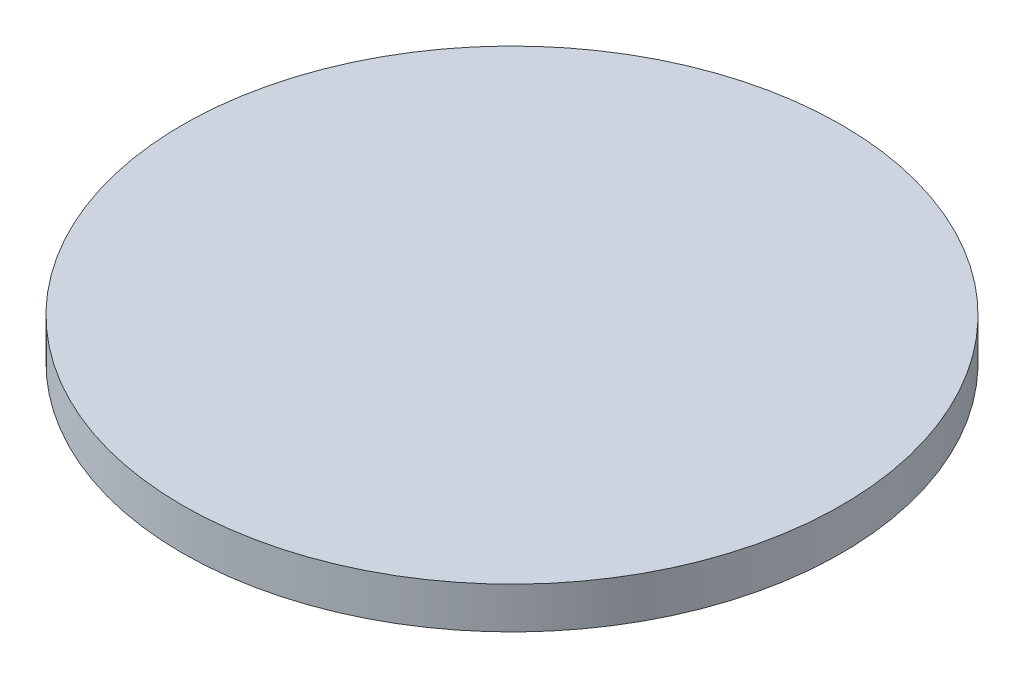
ISO-10303-21;
HEADER;
FILE_DESCRIPTION(('STEP AP214'),'2;1');
FILE_NAME('part.step','',(''),(''),'','','');
FILE_SCHEMA(('AUTOMOTIVE_DESIGN { 1 0 10303 214 1 1 1 1 }'));
ENDSEC;
DATA;
#1=APPLICATION_CONTEXT('core data for automotive mechanical design processes');
#2=APPLICATION_PROTOCOL_DEFINITION('international standard','automotive_design',2000,#1);
#3=PRODUCT_CONTEXT('',#1,'mechanical');
#4=PRODUCT('Part','Part','',(#3));
#5=PRODUCT_RELATED_PRODUCT_CATEGORY('part','',(#4));
#6=PRODUCT_DEFINITION_FORMATION('','',#4);
#7=PRODUCT_DEFINITION_CONTEXT('part definition',#1,'design');
#8=PRODUCT_DEFINITION('design','',#6,#7);
#9=PRODUCT_DEFINITION_SHAPE('','',#8);
#10=(LENGTH_UNIT() NAMED_UNIT(*) SI_UNIT(.MILLI.,.METRE.));
#11=(NAMED_UNIT(*) PLANE_ANGLE_UNIT() SI_UNIT($,.RADIAN.));
#12=(NAMED_UNIT(*) SI_UNIT($,.STERADIAN.) SOLID_ANGLE_UNIT());
#13=UNCERTAINTY_MEASURE_WITH_UNIT(LENGTH_MEASURE(1.E-05),#10,'distance_accuracy_value','');
#14=(GEOMETRIC_REPRESENTATION_CONTEXT(3) GLOBAL_UNCERTAINTY_ASSIGNED_CONTEXT((#13)) GLOBAL_UNIT_ASSIGNED_CONTEXT((#10,
#11,#12)) REPRESENTATION_CONTEXT('',''));
#15=CARTESIAN_POINT('',(0.,0.,0.));
#16=DIRECTION('',(0.,0.,1.));
#17=DIRECTION('',(1.,0.,0.));
#18=AXIS2_PLACEMENT_3D('',#15,#16,#17);
#19=CARTESIAN_POINT('',(0.,5.,0.));
#20=DIRECTION('',(0.,-1.,0.));
#21=DIRECTION('',(0.,0.,-1.));
#22=AXIS2_PLACEMENT_3D('',#19,#20,#21);
#23=CYLINDRICAL_SURFACE('',#22,39.8179700328845);
#24=CARTESIAN_POINT('',(0.,5.,0.));
#25=DIRECTION('',(0.,1.,0.));
#26=DIRECTION('',(0.,0.,1.));
#27=AXIS2_PLACEMENT_3D('',#24,#25,#26);
#28=CIRCLE('',#27,39.8179700328845);
#29=CARTESIAN_POINT('',(0.,5.,39.8179700328845));
#30=VERTEX_POINT('',#29);
#31=EDGE_CURVE('E10',#30,#30,#28,.T.);
#32=ORIENTED_EDGE('',*,*,#31,.F.);
#33=EDGE_LOOP('',(#32));
#34=FACE_BOUND('',#33,.T.);
#35=CARTESIAN_POINT('',(0.,0.,0.));
#36=DIRECTION('',(0.,1.,0.));
#37=DIRECTION('',(0.,0.,1.));
#38=AXIS2_PLACEMENT_3D('',#35,#36,#37);
#39=CIRCLE('',#38,39.8179700328845);
#40=CARTESIAN_POINT('',(0.,0.,39.8179700328845));
#41=VERTEX_POINT('',#40);
#42=EDGE_CURVE('E46',#41,#41,#39,.T.);
#43=ORIENTED_EDGE('',*,*,#42,.T.);
#44=EDGE_LOOP('',(#43));
#45=FACE_BOUND('',#44,.T.);
#46=ADVANCED_FACE('F43',(#34,#45),#23,.T.);
#47=CARTESIAN_POINT('',(0.,5.,0.));
#48=DIRECTION('',(0.,1.,0.));
#49=DIRECTION('',(0.,0.,1.));
#50=AXIS2_PLACEMENT_3D('',#47,#48,#49);
#51=PLANE('',#50);
#52=ORIENTED_EDGE('',*,*,#31,.T.);
#53=EDGE_LOOP('',(#52));
#54=FACE_BOUND('',#53,.T.);
#55=ADVANCED_FACE('F58',(#54),#51,.T.);
#56=CARTESIAN_POINT('',(0.,0.,0.));
#57=DIRECTION('',(0.,1.,0.));
#58=DIRECTION('',(0.,0.,1.));
#59=AXIS2_PLACEMENT_3D('',#56,#57,#58);
#60=PLANE('',#59);
#61=ORIENTED_EDGE('',*,*,#42,.F.);
#62=EDGE_LOOP('',(#61));
#63=FACE_BOUND('',#62,.T.);
#64=ADVANCED_FACE('F56',(#63),#60,.F.);
#65=CLOSED_SHELL('',(#46,#55,#64));
#66=MANIFOLD_SOLID_BREP('B2',#65);
#67=ADVANCED_BREP_SHAPE_REPRESENTATION('',(#18,#66),#14);
#68=SHAPE_DEFINITION_REPRESENTATION(#9,#67);
ENDSEC;
END-ISO-10303-21;
